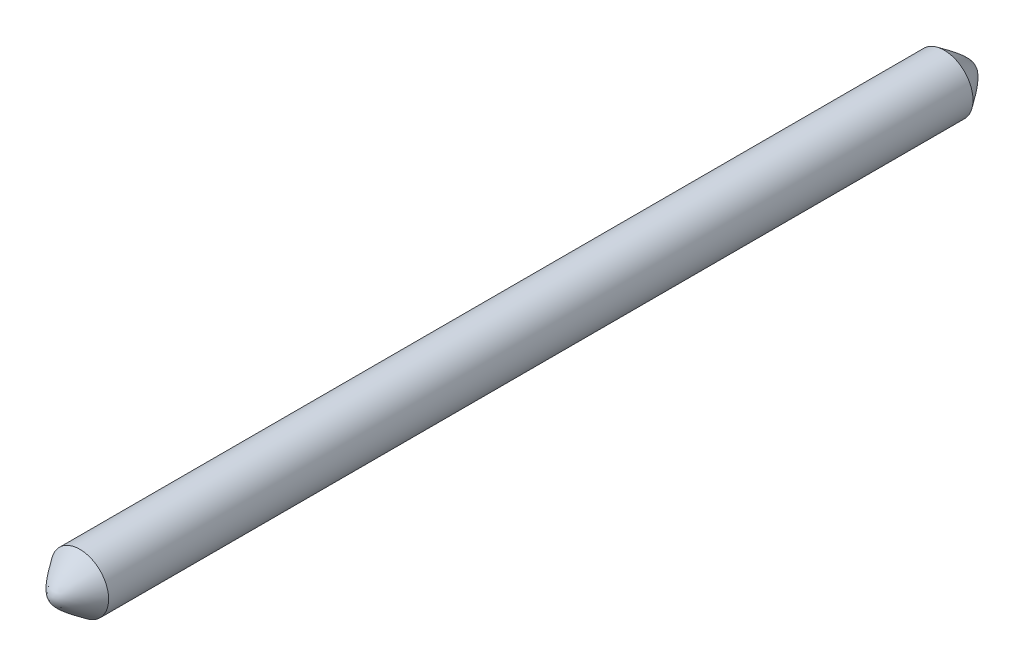
ISO-10303-21;
HEADER;
FILE_DESCRIPTION(('STEP AP214'),'2;1');
FILE_NAME('part.step','',(''),(''),'','','');
FILE_SCHEMA(('AUTOMOTIVE_DESIGN { 1 0 10303 214 1 1 1 1 }'));
ENDSEC;
DATA;
#1=APPLICATION_CONTEXT('core data for automotive mechanical design processes');
#2=APPLICATION_PROTOCOL_DEFINITION('international standard','automotive_design',2000,#1);
#3=PRODUCT_CONTEXT('',#1,'mechanical');
#4=PRODUCT('Part','Part','',(#3));
#5=PRODUCT_RELATED_PRODUCT_CATEGORY('part','',(#4));
#6=PRODUCT_DEFINITION_FORMATION('','',#4);
#7=PRODUCT_DEFINITION_CONTEXT('part definition',#1,'design');
#8=PRODUCT_DEFINITION('design','',#6,#7);
#9=PRODUCT_DEFINITION_SHAPE('','',#8);
#10=(LENGTH_UNIT() NAMED_UNIT(*) SI_UNIT(.MILLI.,.METRE.));
#11=(NAMED_UNIT(*) PLANE_ANGLE_UNIT() SI_UNIT($,.RADIAN.));
#12=(NAMED_UNIT(*) SI_UNIT($,.STERADIAN.) SOLID_ANGLE_UNIT());
#13=UNCERTAINTY_MEASURE_WITH_UNIT(LENGTH_MEASURE(1.E-05),#10,'distance_accuracy_value','');
#14=(GEOMETRIC_REPRESENTATION_CONTEXT(3) GLOBAL_UNCERTAINTY_ASSIGNED_CONTEXT((#13)) GLOBAL_UNIT_ASSIGNED_CONTEXT((#10,
#11,#12)) REPRESENTATION_CONTEXT('',''));
#15=CARTESIAN_POINT('',(0.,0.,0.));
#16=DIRECTION('',(0.,0.,1.));
#17=DIRECTION('',(1.,0.,0.));
#18=AXIS2_PLACEMENT_3D('',#15,#16,#17);
#19=CARTESIAN_POINT('',(0.,0.,76.2));
#20=DIRECTION('',(0.,0.,-1.));
#21=DIRECTION('',(-1.,0.,0.));
#22=AXIS2_PLACEMENT_3D('',#19,#20,#21);
#23=CYLINDRICAL_SURFACE('',#22,2.54);
#24=CARTESIAN_POINT('',(-2.54,-3.04103801602312E-12,76.2000845862362));
#25=CARTESIAN_POINT('',(-2.53999349698304,-0.13717648567686,76.200086927595));
#26=CARTESIAN_POINT('',(-2.5288527893179,-0.27443602373664,76.2001572765836));
#27=CARTESIAN_POINT('',(-2.48454768169249,-0.545451641506615,76.2001467424428));
#28=CARTESIAN_POINT('',(-2.4513602275577,-0.679203901324439,76.200065700844));
#29=CARTESIAN_POINT('',(-2.36206879535816,-0.944781802777988,76.2000170492411));
#30=CARTESIAN_POINT('',(-2.30510856573511,-1.07632091119194,76.2000540629433));
#31=CARTESIAN_POINT('',(-2.16992153988975,-1.32794728360604,76.2001255905543));
#32=CARTESIAN_POINT('',(-2.0916967347683,-1.44803561837391,76.2001601046968));
#33=CARTESIAN_POINT('',(-1.91618766254466,-1.67338435613288,76.2001956490769));
#34=CARTESIAN_POINT('',(-1.81890261658949,-1.77864415288757,76.2001966779458));
#35=CARTESIAN_POINT('',(-1.60806112702091,-1.97133178040241,76.2001847639142));
#36=CARTESIAN_POINT('',(-1.49450452188264,-2.05875943412517,76.2001718208751));
#37=CARTESIAN_POINT('',(-1.2542502504054,-2.21332989103388,76.2001080802919));
#38=CARTESIAN_POINT('',(-1.12755265155972,-2.28047279839711,76.2000572829423));
#39=CARTESIAN_POINT('',(-0.930553601798192,-2.36448585793705,76.2000361479739));
#40=CARTESIAN_POINT('',(-0.863697162202112,-2.3897141680493,76.2000382930603));
#41=CARTESIAN_POINT('',(-0.728079452450315,-2.43445904702555,76.2000774588079));
#42=CARTESIAN_POINT('',(-0.659318182294058,-2.45397561588793,76.2001144794691));
#43=CARTESIAN_POINT('',(-0.520400636507164,-2.48714404554093,76.2001613922752));
#44=CARTESIAN_POINT('',(-0.450244362721884,-2.50079591408905,76.200171284456));
#45=CARTESIAN_POINT('',(-0.309029910428212,-2.52214173017177,76.2001579222221));
#46=CARTESIAN_POINT('',(-0.237971731909446,-2.52983567763785,76.200134667807));
#47=CARTESIAN_POINT('',(-0.0954602281356198,-2.53920990590346,76.2001042604644));
#48=CARTESIAN_POINT('',(-0.0240069035094651,-2.54089019627143,76.2000971075114));
#49=CARTESIAN_POINT('',(0.118787306432225,-2.53822554125827,76.2001070490109));
#50=CARTESIAN_POINT('',(0.190128191748127,-2.53388059589681,76.2001241434634));
#51=CARTESIAN_POINT('',(0.332190652667195,-2.51919599413905,76.2001583917437));
#52=CARTESIAN_POINT('',(0.402912228033873,-2.50885633545373,76.2001755455715));
#53=CARTESIAN_POINT('',(0.543231813505336,-2.48225691237585,76.2001596205534));
#54=CARTESIAN_POINT('',(0.612829823596703,-2.46599714791259,76.2001265417068));
#55=CARTESIAN_POINT('',(0.750412983259382,-2.42766906971521,76.2000709369931));
#56=CARTESIAN_POINT('',(0.818398131771,-2.40560075216483,76.2000484111331));
#57=CARTESIAN_POINT('',(0.952251821774828,-2.3558274728542,76.2000349635544));
#58=CARTESIAN_POINT('',(1.01812036331188,-2.32812251121338,76.2000440418351));
#59=CARTESIAN_POINT('',(1.21184773989405,-2.23681826196654,76.2000854991792));
#60=CARTESIAN_POINT('',(1.33595217457533,-2.16499498600948,76.2001320915661));
#61=CARTESIAN_POINT('',(1.57027157572695,-2.00156996766211,76.2001848964266));
#62=CARTESIAN_POINT('',(1.68048654540007,-1.90996822983255,76.2001911089096));
#63=CARTESIAN_POINT('',(1.88399326344693,-1.70954605971817,76.2001938939493));
#64=CARTESIAN_POINT('',(1.97728498298651,-1.60072559809637,76.2001904664897));
#65=CARTESIAN_POINT('',(2.14426666713311,-1.36899021244833,76.2001411447618));
#66=CARTESIAN_POINT('',(2.21795663011954,-1.24607528725683,76.2000952504902));
#67=CARTESIAN_POINT('',(2.34366835650132,-0.989540395601292,76.2000347219431));
#68=CARTESIAN_POINT('',(2.39569012156701,-0.855920429962477,76.2000200876654));
#69=CARTESIAN_POINT('',(2.45632835741329,-0.650518649891663,76.2000903839677));
#70=CARTESIAN_POINT('',(2.47364585753888,-0.58119083949307,76.2001292284798));
#71=CARTESIAN_POINT('',(2.50238702423857,-0.441304519650376,76.2001592117772));
#72=CARTESIAN_POINT('',(2.51381069092007,-0.370746010228701,76.2001503505635));
#73=CARTESIAN_POINT('',(2.53067122012654,-0.228922439095543,76.2001204634017));
#74=CARTESIAN_POINT('',(2.536108091959,-0.157657378482686,76.2000994374726));
#75=CARTESIAN_POINT('',(2.54095962349172,-0.0149213361028563,76.200081009595));
#76=CARTESIAN_POINT('',(2.54037428316434,0.0565496456650631,76.2000836076466));
#77=CARTESIAN_POINT('',(2.53318444340542,0.199188204579735,76.2001096025685));
#78=CARTESIAN_POINT('',(2.52657994373368,0.27035578171438,76.2001329994397));
#79=CARTESIAN_POINT('',(2.5073999588077,0.411880497597634,76.2001543458698));
#80=CARTESIAN_POINT('',(2.49482447362679,0.482237636356196,76.2001522954289));
#81=CARTESIAN_POINT('',(2.46378814005909,0.621646844643629,76.2001127195962));
#82=CARTESIAN_POINT('',(2.44532728848407,0.690698913465492,76.2000751941851));
#83=CARTESIAN_POINT('',(2.40266535111888,0.826985957103936,76.2000331088692));
#84=CARTESIAN_POINT('',(2.37846426541206,0.894220931946898,76.2000285489639));
#85=CARTESIAN_POINT('',(2.29747912490954,1.09248381283008,76.2000455683079));
#86=CARTESIAN_POINT('',(2.23228513092784,1.2201951522415,76.2000977839282));
#87=CARTESIAN_POINT('',(2.08141379655454,1.46278855307947,76.2001659398644));
#88=CARTESIAN_POINT('',(1.99573646275967,1.57767061863771,76.200181880192));
#89=CARTESIAN_POINT('',(1.80630217486014,1.79143938224338,76.2001971157752));
#90=CARTESIAN_POINT('',(1.7025452144082,1.89032607467524,76.2001964110249));
#91=CARTESIAN_POINT('',(1.47990449938466,2.06927160933155,76.2001658634328));
#92=CARTESIAN_POINT('',(1.36102072525969,2.14933042721815,76.2001360205533));
#93=CARTESIAN_POINT('',(1.11149932067629,2.28835417428832,76.2000644010815));
#94=CARTESIAN_POINT('',(0.980861701226447,2.34731912322804,76.2000226245004));
#95=CARTESIAN_POINT('',(0.711541581773306,2.44247952887531,76.2000710597563));
#96=CARTESIAN_POINT('',(0.572859087692815,2.478675002346,76.2001612714961));
#97=CARTESIAN_POINT('',(0.291385516194262,2.527269590301,76.2001761004787));
#98=CARTESIAN_POINT('',(0.148594432147317,2.53966866638953,76.2001007174542));
#99=CARTESIAN_POINT('',(-0.137042522626879,2.54031819908428,76.2001001422658));
#100=CARTESIAN_POINT('',(-0.279888393305554,2.52856867705171,76.200174949969));
#101=CARTESIAN_POINT('',(-0.56158028390111,2.48125471956424,76.2001617298856));
#102=CARTESIAN_POINT('',(-0.700426296981659,2.44569024340867,76.2000737018206));
#103=CARTESIAN_POINT('',(-0.970179164637419,2.35175463815053,76.2000238788853));
#104=CARTESIAN_POINT('',(-1.10108588913962,2.29338313550651,76.2000620860826));
#105=CARTESIAN_POINT('',(-1.35123663520306,2.15549472711476,76.2001320119273));
#106=CARTESIAN_POINT('',(-1.47048105825638,2.07597854965464,76.200163730798));
#107=CARTESIAN_POINT('',(-1.69391906919926,1.89805867140753,76.2001962380119));
#108=CARTESIAN_POINT('',(-1.79811405722282,1.79965672965617,76.2001970292343));
#109=CARTESIAN_POINT('',(-1.98852249856104,1.58675488161058,76.2001829769784));
#110=CARTESIAN_POINT('',(-2.07473201349221,1.4722514586515,76.2001681300801));
#111=CARTESIAN_POINT('',(-2.22675375729282,1.23026961296691,76.2001012248612));
#112=CARTESIAN_POINT('',(-2.29255737097996,1.10278574010566,76.2000491508542));
#113=CARTESIAN_POINT('',(-2.37444341048816,0.904840600688562,76.2000284008782));
#114=CARTESIAN_POINT('',(-2.39893509323458,0.837740898730401,76.2000310435477));
#115=CARTESIAN_POINT('',(-2.44218554902602,0.701723595794444,76.2000712496223));
#116=CARTESIAN_POINT('',(-2.4609456779445,0.632806428958704,76.20010880476));
#117=CARTESIAN_POINT('',(-2.49775753871346,0.470915441641373,76.2001547524733));
#118=CARTESIAN_POINT('',(-2.51358270394138,0.377426423208198,76.2001496390599));
#119=CARTESIAN_POINT('',(-2.53470570006507,0.189304719426003,76.2001137468319));
#120=CARTESIAN_POINT('',(-2.54000448804707,0.0946721388399207,76.200082970351));
#121=CARTESIAN_POINT('',(-2.54,-3.04103801602312E-12,76.2000845862362));
#122=B_SPLINE_CURVE_WITH_KNOTS('',3,(#24,#25,#26,#27,#28,#29,#30,#31,#32,#33,#34,#35,#36,#37,
#38,#39,#40,#41,#42,#43,#44,#45,#46,#47,#48,#49,#50,#51,#52,#53,#54,#55,#56,#57,#58,#59,#60,#61,
#62,#63,#64,#65,#66,#67,#68,#69,#70,#71,#72,#73,#74,#75,#76,#77,#78,#79,#80,#81,#82,#83,#84,#85,
#86,#87,#88,#89,#90,#91,#92,#93,#94,#95,#96,#97,#98,#99,#100,#101,#102,#103,#104,#105,#106,#107,
#108,#109,#110,#111,#112,#113,#114,#115,#116,#117,#118,#119,#120,#121),.UNSPECIFIED.,.T.,.F.,(4,
2,2,2,2,2,2,2,2,2,2,2,2,2,2,2,2,2,2,2,2,2,2,2,2,2,2,2,2,2,2,2,2,2,2,2,2,2,2,2,2,2,2,2,2,2,2,2,
4),(0.,0.411222455094431,0.822875601804982,1.2508464555965,1.67877725028623,2.10672553503377,
2.53467806824199,2.96262840355756,3.17679434671601,3.39096028993523,3.60512594986732,
3.81929161226285,4.0334569338954,4.24762225482866,4.4617876575391,4.67595306280738,
4.89011860878439,5.10428415022407,5.53223430473072,5.96018436055584,6.38813514552334,
6.81608596587214,7.24403675323145,7.45820255709704,7.67236835706012,7.88653382406545,
8.10069929205418,8.31486476859012,8.52903024249617,8.74319583242052,8.95736141923535,
9.38531172792534,9.8132618987926,10.2412122199023,10.6691630941991,11.0971135676836,
11.525063726106,11.9530145750308,12.3809650454017,12.8089162471581,13.2368744583428,
13.6648179312398,14.0927215644558,14.5207188000932,14.9488964869562,15.1629737878919,
15.3770004067804,15.6608307541973,15.9446352938224),.UNSPECIFIED.);
#123=CARTESIAN_POINT('',(-2.54,-3.04103801602312E-12,76.2000845862362));
#124=VERTEX_POINT('',#123);
#125=EDGE_CURVE('E12',#124,#124,#122,.T.);
#126=ORIENTED_EDGE('',*,*,#125,.F.);
#127=EDGE_LOOP('',(#126));
#128=FACE_BOUND('',#127,.T.);
#129=CARTESIAN_POINT('',(-2.54,2.079697605941E-12,-8.45862354822719E-05));
#130=CARTESIAN_POINT('',(-2.53999349698332,-0.137176486129843,-8.69312459131235E-05));
#131=CARTESIAN_POINT('',(-2.52885278924446,-0.274436024648278,-0.000157275442477184));
#132=CARTESIAN_POINT('',(-2.48454768132177,-0.545451643310888,-0.000146750046882967));
#133=CARTESIAN_POINT('',(-2.45136022696289,-0.679203903562601,-6.57220046150355E-05));
#134=CARTESIAN_POINT('',(-2.36206879431232,-0.944781805401333,-1.71163433484851E-05));
#135=CARTESIAN_POINT('',(-2.30510856452686,-1.07632091378649,-5.41631553808292E-05));
#136=CARTESIAN_POINT('',(-2.16992153835465,-1.32794728611766,-0.000125708967258491));
#137=CARTESIAN_POINT('',(-2.09169673306958,-1.44803562083185,-0.000160208205260677));
#138=CARTESIAN_POINT('',(-1.91618766047624,-1.67338435851193,-0.000195694788074507));
#139=CARTESIAN_POINT('',(-1.81890261430442,-1.77864415523318,-0.000196680763137622));
#140=CARTESIAN_POINT('',(-1.60806112430609,-1.97133178262602,-0.000184686786333742));
#141=CARTESIAN_POINT('',(-1.4945045189544,-2.0587594362599,-0.000171706695819512));
#142=CARTESIAN_POINT('',(-1.25425024708615,-2.21332989291893,-0.000107948029528802));
#143=CARTESIAN_POINT('',(-1.12755264806743,-2.28047280012844,-5.71696478925056E-05));
#144=CARTESIAN_POINT('',(-0.930553598071686,-2.3644858594048,-3.60939634736529E-05));
#145=CARTESIAN_POINT('',(-0.863697158401242,-2.38971416942376,-3.82639678967028E-05));
#146=CARTESIAN_POINT('',(-0.728079448520029,-2.43445904820206,-7.74768091871421E-05));
#147=CARTESIAN_POINT('',(-0.65931817830875,-2.45397561695987,-0.000114519646063877));
#148=CARTESIAN_POINT('',(-0.520400632488693,-2.48714404637994,-0.000161453281130502));
#149=CARTESIAN_POINT('',(-0.45024435872694,-2.50079591480668,-0.000171344115268003));
#150=CARTESIAN_POINT('',(-0.309029906494981,-2.52214173065257,-0.000157968984503399));
#151=CARTESIAN_POINT('',(-0.237971728014362,-2.52983567800293,-0.000134703019218479));
#152=CARTESIAN_POINT('',(-0.0954602243259275,-2.53920990604519,-0.000104274030817158));
#153=CARTESIAN_POINT('',(-0.0240068997470274,-2.54089019630567,-9.71109820787086E-05));
#154=CARTESIAN_POINT('',(0.118787310095086,-2.53822554108546,-0.000107031811431813));
#155=CARTESIAN_POINT('',(0.190128195358668,-2.5338805956245,-0.000124115689443927));
#156=CARTESIAN_POINT('',(0.332190656078464,-2.51919599368555,-0.000158342990452021));
#157=CARTESIAN_POINT('',(0.40291223129892,-2.50885633492559,-0.000175486413470665));
#158=CARTESIAN_POINT('',(0.543231816476633,-2.48225691172179,-0.000159561655562934));
#159=CARTESIAN_POINT('',(0.61282982642048,-2.46599714720729,-0.000126493474037246));
#160=CARTESIAN_POINT('',(0.750412985796606,-2.42766906892708,-7.09247658673354E-05));
#161=CARTESIAN_POINT('',(0.818398134169137,-2.40560075134492,-4.84242461665313E-05));
#162=CARTESIAN_POINT('',(0.952251823886538,-2.35582747199702,-3.50240251187403E-05));
#163=CARTESIAN_POINT('',(1.01812036527618,-2.3281225103505,-4.41243231033805E-05));
#164=CARTESIAN_POINT('',(1.21184774186525,-2.23681826091222,-8.56276266540891E-05));
#165=CARTESIAN_POINT('',(1.33595217667864,-2.16499498472673,-0.000132223938123295));
#166=CARTESIAN_POINT('',(1.57027157802918,-2.00156996587195,-0.00018499014073983));
#167=CARTESIAN_POINT('',(1.68048654776954,-1.90996822776399,-0.000191160041210358));
#168=CARTESIAN_POINT('',(1.88399326562969,-1.70954605730372,-0.000193863345597776));
#169=CARTESIAN_POINT('',(1.97728498495493,-1.60072559565471,-0.00019039673311851));
#170=CARTESIAN_POINT('',(2.14426666868889,-1.3689902099989,-0.000141031606666379));
#171=CARTESIAN_POINT('',(2.21795663147745,-1.24607528482714,-9.51330891863517E-05));
#172=CARTESIAN_POINT('',(2.34366835759409,-0.989540393030477,-3.46360296225854E-05));
#173=CARTESIAN_POINT('',(2.39569012255613,-0.855920427212822,-2.00374851785729E-05));
#174=CARTESIAN_POINT('',(2.45632835820875,-0.650518646895561,-9.03709279638559E-05));
#175=CARTESIAN_POINT('',(2.47364585826356,-0.581190836416947,-0.000129225077553642));
#176=CARTESIAN_POINT('',(2.50238702481083,-0.441304516414878,-0.000159212244155626));
#177=CARTESIAN_POINT('',(2.51381069141074,-0.370746006913862,-0.000150345262037889));
#178=CARTESIAN_POINT('',(2.53067122042823,-0.228922435745026,-0.000120453660548074));
#179=CARTESIAN_POINT('',(2.53610809216303,-0.157657375176983,-9.94290600969332E-05));
#180=CARTESIAN_POINT('',(2.54095962350909,-0.0149213328953274,-8.10081788546456E-05));
#181=CARTESIAN_POINT('',(2.5403742830927,0.0565496488192297,-8.36118981719666E-05));
#182=CARTESIAN_POINT('',(2.53318444316482,0.199188207620088,-0.000109611825319258));
#183=CARTESIAN_POINT('',(2.52657994341321,0.270355784694285,-0.000133008033978732));
#184=CARTESIAN_POINT('',(2.5073999583377,0.411880500450276,-0.000154349475165498));
#185=CARTESIAN_POINT('',(2.494824473087,0.482237639142006,-0.000152294708004791));
#186=CARTESIAN_POINT('',(2.4637881393744,0.621646847358165,-0.000112726698577826));
#187=CARTESIAN_POINT('',(2.44532728771922,0.690698916174468,-7.52134370724439E-05));
#188=CARTESIAN_POINT('',(2.40266535019504,0.826985959789227,-3.3155962153685E-05));
#189=CARTESIAN_POINT('',(2.37846426440946,0.894220934614094,-2.86117482611294E-05));
#190=CARTESIAN_POINT('',(2.29747912367393,1.09248381543134,-4.56698032324641E-05));
#191=CARTESIAN_POINT('',(2.23228512954164,1.22019515478068,-9.79001225278873E-05));
#192=CARTESIAN_POINT('',(2.08141379485116,1.4627885555077,-0.00016604244634304));
#193=CARTESIAN_POINT('',(1.99573646088489,1.57767062101406,-0.000181954462550667));
#194=CARTESIAN_POINT('',(1.80630217265041,1.7914393844764,-0.000197115984638405));
#195=CARTESIAN_POINT('',(1.70254521203461,1.89032607681652,-0.000196365484668448));
#196=CARTESIAN_POINT('',(1.47990449681619,2.06927161116236,-0.000165749986388275));
#197=CARTESIAN_POINT('',(1.36102072267567,2.1493304288495,-0.000135884950473209));
#198=CARTESIAN_POINT('',(1.11149931808724,2.28835417553922,-6.42899917222969E-05));
#199=CARTESIAN_POINT('',(0.980861698648231,2.34731912429851,-2.25600799992683E-05));
#200=CARTESIAN_POINT('',(0.711541579325772,2.44247952958061,-7.10780801102821E-05));
#201=CARTESIAN_POINT('',(0.572859085368116,2.478675002875,-0.000161325894731721));
#202=CARTESIAN_POINT('',(0.29138551413391,2.52726959052905,-0.000176161020684314));
#203=CARTESIAN_POINT('',(0.148594430228496,2.53966866649304,-0.000100748064721021));
#204=CARTESIAN_POINT('',(-0.137042524284037,2.5403181989889,-0.00010011332892323));
#205=CARTESIAN_POINT('',(-0.279888394842595,2.52856867687614,-0.000174891416269981));
#206=CARTESIAN_POINT('',(-0.561580285200612,2.48125471926337,-0.000161674972452756));
#207=CARTESIAN_POINT('',(-0.700426298163741,2.44569024306272,-7.36801631033609E-05));
#208=CARTESIAN_POINT('',(-0.970179165769571,2.3517546376906,-2.39389927954955E-05));
#209=CARTESIAN_POINT('',(-1.10108589032727,2.29338313494327,-6.21946998790931E-05));
#210=CARTESIAN_POINT('',(-1.3512366364864,2.15549472631592,-0.000132148229642129));
#211=CARTESIAN_POINT('',(-1.4704810595801,2.07597854872386,-0.000163846278120754));
#212=CARTESIAN_POINT('',(-1.69391907062904,1.89805867014577,-0.00019628695957896));
#213=CARTESIAN_POINT('',(-1.79811405870965,1.79965672818453,-0.000197032474080924));
#214=CARTESIAN_POINT('',(-1.98852250009947,1.58675487969941,-0.000182905286871246));
#215=CARTESIAN_POINT('',(-2.0747320150248,1.47225145651036,-0.000168029168693499));
#216=CARTESIAN_POINT('',(-2.22675375870252,1.23026961042495,-0.000101108264569159));
#217=CARTESIAN_POINT('',(-2.29255737228623,1.10278573740149,-4.90478103222366E-05));
#218=CARTESIAN_POINT('',(-2.37444341160543,0.904840597760344,-2.83357492784886E-05));
#219=CARTESIAN_POINT('',(-2.3989350942831,0.837740895731174,-3.09939872892971E-05));
#220=CARTESIAN_POINT('',(-2.44218554992683,0.701723592663662,-7.12284154040713E-05));
#221=CARTESIAN_POINT('',(-2.46094567876639,0.632806425767387,-0.000108796338656579));
#222=CARTESIAN_POINT('',(-2.49775753920733,0.470915438908615,-0.000154754397359705));
#223=CARTESIAN_POINT('',(-2.51358270425039,0.377426421010254,-0.000149632218354874));
#224=CARTESIAN_POINT('',(-2.5347057001271,0.189304718318811,-0.000113737768605902));
#225=CARTESIAN_POINT('',(-2.54000448804684,0.0946721382886521,-8.29678301851751E-05));
#226=CARTESIAN_POINT('',(-2.54,2.079697605941E-12,-8.45862354822719E-05));
#227=B_SPLINE_CURVE_WITH_KNOTS('',3,(#129,#130,#131,#132,#133,#134,#135,#136,#137,#138,#139,
#140,#141,#142,#143,#144,#145,#146,#147,#148,#149,#150,#151,#152,#153,#154,#155,#156,#157,#158,
#159,#160,#161,#162,#163,#164,#165,#166,#167,#168,#169,#170,#171,#172,#173,#174,#175,#176,#177,
#178,#179,#180,#181,#182,#183,#184,#185,#186,#187,#188,#189,#190,#191,#192,#193,#194,#195,#196,
#197,#198,#199,#200,#201,#202,#203,#204,#205,#206,#207,#208,#209,#210,#211,#212,#213,#214,#215,
#216,#217,#218,#219,#220,#221,#222,#223,#224,#225,#226),.UNSPECIFIED.,.T.,.F.,(4,2,2,2,2,2,2,2,
2,2,2,2,2,2,2,2,2,2,2,2,2,2,2,2,2,2,2,2,2,2,2,2,2,2,2,2,2,2,2,2,2,2,2,2,2,2,2,2,4),(0.,
0.411222456470183,0.822875604564655,1.25084645849013,1.67877725329704,2.10672553839943,
2.53467807197068,2.9626284075005,3.17679435076912,3.39096029409514,3.60512595387826,
3.81929161613405,4.03345693762133,4.24762225840695,4.4617876607175,4.67595306558427,
4.89011861116692,5.10428415221987,5.53223430740273,5.96018436389108,6.38813514852037,
6.81608596852145,7.24403675625155,7.45820256031152,7.67236836046676,7.88653382731602,
8.10069929514843,8.31486477152482,8.5290302452758,8.74319583522906,8.95736142206961,
9.38531173081882,9.81326190184575,10.2412122231224,10.6691630971479,11.0971135703497,
11.5250637283304,11.9530145768113,12.3809650468417,12.8089162482573,13.236874459747,
13.664817932942,14.0927215667021,14.5207188028927,14.9488964900231,15.1629737910897,
15.3770004101076,15.6608307558549,15.9446352938137),.UNSPECIFIED.);
#228=CARTESIAN_POINT('',(-2.54,2.079697605941E-12,-8.45862354822719E-05));
#229=VERTEX_POINT('',#228);
#230=EDGE_CURVE('E106',#229,#229,#227,.T.);
#231=ORIENTED_EDGE('',*,*,#230,.T.);
#232=EDGE_LOOP('',(#231));
#233=FACE_BOUND('',#232,.T.);
#234=ADVANCED_FACE('F93',(#128,#233),#23,.T.);
#235=CARTESIAN_POINT('',(2.67819313749806,-2.59079773194686,74.6730244196627));
#236=CARTESIAN_POINT('',(2.2496833228468,-2.59079773194686,75.0417048025762));
#237=CARTESIAN_POINT('',(1.82117350819554,-2.59079773194686,75.3768045349288));
#238=CARTESIAN_POINT('',(1.39266369354428,-2.59079773194686,75.6893760880397));
#239=CARTESIAN_POINT('',(0.749898065491891,-2.59079773194686,76.0448564194377));
#240=CARTESIAN_POINT('',(0.107132437439498,-2.59079773194686,76.1428723886347));
#241=CARTESIAN_POINT('',(-0.107123375961637,-2.59079773194686,76.1428729683075));
#242=CARTESIAN_POINT('',(-0.749890816165043,-2.59079773194686,76.0448596365343));
#243=CARTESIAN_POINT('',(-1.39265825636845,-2.59079773194686,75.6893804475238));
#244=CARTESIAN_POINT('',(-1.82116988317072,-2.59079773194686,75.3768076792929));
#245=CARTESIAN_POINT('',(-2.24968150997299,-2.59079773194686,75.0417064704964));
#246=CARTESIAN_POINT('',(-2.67819313677526,-2.59079773194686,74.673024385175));
#247=CARTESIAN_POINT('',(2.67819313749806,-2.17627114646064,75.0105335618225));
#248=CARTESIAN_POINT('',(2.2496833228468,-2.17627114646064,75.436658922903));
#249=CARTESIAN_POINT('',(1.82117350819554,-2.17627114646064,75.8286275366601));
#250=CARTESIAN_POINT('',(1.39266369354428,-2.17627114646064,76.2007149807891));
#251=CARTESIAN_POINT('',(0.749898065491891,-2.17627114646064,76.6278016196594));
#252=CARTESIAN_POINT('',(0.107132437439498,-2.17627114646064,76.7457410884326));
#253=CARTESIAN_POINT('',(-0.107123375961637,-2.17627114646064,76.7457417545829));
#254=CARTESIAN_POINT('',(-0.749890816165043,-2.17627114646064,76.6278056727853));
#255=CARTESIAN_POINT('',(-1.39265825636845,-2.17627114646064,76.2007201683081));
#256=CARTESIAN_POINT('',(-1.82116988317072,-2.17627114646064,75.8286308400438));
#257=CARTESIAN_POINT('',(-2.24968150997299,-2.17627114646064,75.4366606628805));
#258=CARTESIAN_POINT('',(-2.67819313677526,-2.17627114646064,75.0105333673022));
#259=CARTESIAN_POINT('',(2.67819313749806,-1.76174456097442,75.3167605782808));
#260=CARTESIAN_POINT('',(2.2496833228468,-1.76174456097442,75.799748697046));
#261=CARTESIAN_POINT('',(1.82117350819554,-1.76174456097442,76.2477220283151));
#262=CARTESIAN_POINT('',(1.39266369354428,-1.76174456097442,76.6809650751832));
#263=CARTESIAN_POINT('',(0.749898065491891,-1.76174456097442,77.1818128554323));
#264=CARTESIAN_POINT('',(0.107132437439498,-1.76174456097442,77.320347900532));
#265=CARTESIAN_POINT('',(-0.107123375961637,-1.76174456097442,77.3203486140961));
#266=CARTESIAN_POINT('',(-0.749890816165043,-1.76174456097442,77.1818180053322));
#267=CARTESIAN_POINT('',(-1.39265825636845,-1.76174456097442,76.6809706702815));
#268=CARTESIAN_POINT('',(-1.82116988317072,-1.76174456097442,76.2477257269208));
#269=CARTESIAN_POINT('',(-2.24968150997299,-1.76174456097442,75.799750614253));
#270=CARTESIAN_POINT('',(-2.67819313677526,-1.76174456097442,75.3167602315485));
#271=CARTESIAN_POINT('',(2.67819313749806,-1.3472179754882,75.6015250749));
#272=CARTESIAN_POINT('',(2.2496833228468,-1.3472179754882,76.144391996381));
#273=CARTESIAN_POINT('',(1.82117350819554,-1.3472179754882,76.6534217396383));
#274=CARTESIAN_POINT('',(1.39266369354428,-1.3472179754882,77.1526084685881));
#275=CARTESIAN_POINT('',(0.749898065491891,-1.3472179754882,77.7218522383194));
#276=CARTESIAN_POINT('',(0.107132437439498,-1.3472179754882,77.8814731000794));
#277=CARTESIAN_POINT('',(-0.107123375961637,-1.3472179754882,77.8814740615217));
#278=CARTESIAN_POINT('',(-0.749890816165043,-1.3472179754882,77.7218577576074));
#279=CARTESIAN_POINT('',(-1.39265825636845,-1.3472179754882,77.1526149253162));
#280=CARTESIAN_POINT('',(-1.82116988317072,-1.3472179754882,76.6534260067408));
#281=CARTESIAN_POINT('',(-2.24968150997299,-1.3472179754882,76.1443939707539));
#282=CARTESIAN_POINT('',(-2.67819313677526,-1.3472179754882,75.6015248675513));
#283=CARTESIAN_POINT('',(2.67819313749806,-0.725427220903692,75.9234747955059));
#284=CARTESIAN_POINT('',(2.2496833228468,-0.725427220903692,76.5385886883884));
#285=CARTESIAN_POINT('',(1.82117350819554,-0.725427220903692,77.1227963601869));
#286=CARTESIAN_POINT('',(1.39266369354428,-0.725427220903692,77.6912278413897));
#287=CARTESIAN_POINT('',(0.749898065491891,-0.725427220903692,78.3911910733647));
#288=CARTESIAN_POINT('',(0.107132437439498,-0.725427220903692,78.5906167130612));
#289=CARTESIAN_POINT('',(-0.107123375961637,-0.725427220903692,78.5906178049262));
#290=CARTESIAN_POINT('',(-0.749890816165043,-0.725427220903692,78.3911981488907));
#291=CARTESIAN_POINT('',(-1.39265825636845,-0.725427220903692,77.6912352607034));
#292=CARTESIAN_POINT('',(-1.82116988317072,-0.725427220903692,77.1228010544237));
#293=CARTESIAN_POINT('',(-2.24968150997299,-0.725427220903692,76.5385914054992));
#294=CARTESIAN_POINT('',(-2.67819313677526,-0.725427220903692,75.9234749327156));
#295=CARTESIAN_POINT('',(2.67819313749806,-0.103636466319185,76.0120266273465));
#296=CARTESIAN_POINT('',(2.2496833228468,-0.103636466319185,76.6473382107532));
#297=CARTESIAN_POINT('',(1.82117350819554,-0.103636466319185,77.2524988312001));
#298=CARTESIAN_POINT('',(1.39266369354428,-0.103636466319185,77.8425109851798));
#299=CARTESIAN_POINT('',(0.749898065491891,-0.103636466319185,78.5823656702481));
#300=CARTESIAN_POINT('',(0.107132437439498,-0.103636466319185,78.8112670490042));
#301=CARTESIAN_POINT('',(-0.107123375961637,-0.103636466319185,78.8112684470053));
#302=CARTESIAN_POINT('',(-0.749890816165043,-0.103636466319185,78.5823733022116));
#303=CARTESIAN_POINT('',(-1.39265825636845,-0.103636466319185,77.8425185884543));
#304=CARTESIAN_POINT('',(-1.82116988317072,-0.103636466319185,77.2525040151777));
#305=CARTESIAN_POINT('',(-2.24968150997299,-0.103636466319185,76.6473408276762));
#306=CARTESIAN_POINT('',(-2.67819313677526,-0.103636466319185,76.0120265732502));
#307=CARTESIAN_POINT('',(2.67819313749806,0.103627702779104,76.0120270718564));
#308=CARTESIAN_POINT('',(2.2496833228468,0.103627702779104,76.6473387798656));
#309=CARTESIAN_POINT('',(1.82117350819554,0.103627702779104,77.2524996438106));
#310=CARTESIAN_POINT('',(1.39266369354428,0.103627702779104,77.8425118206908));
#311=CARTESIAN_POINT('',(0.749898065491891,0.103627702779104,78.5823667411451));
#312=CARTESIAN_POINT('',(0.107132437439498,0.103627702779104,78.8112683998033));
#313=CARTESIAN_POINT('',(-0.107123375961637,0.103627702779104,78.8112697979067));
#314=CARTESIAN_POINT('',(-0.749890816165043,0.103627702779104,78.5823743478487));
#315=CARTESIAN_POINT('',(-1.39265825636845,0.103627702779104,77.8425195083865));
#316=CARTESIAN_POINT('',(-1.82116988317072,0.103627702779104,77.2525046455308));
#317=CARTESIAN_POINT('',(-2.24968150997299,0.103627702779104,76.6473415014849));
#318=CARTESIAN_POINT('',(-2.67819313677526,0.103627702779104,76.0120271405603));
#319=CARTESIAN_POINT('',(2.67819313749806,0.725420210073973,75.9234780743535));
#320=CARTESIAN_POINT('',(2.2496833228468,0.725420210073973,76.5385926697384));
#321=CARTESIAN_POINT('',(1.82117350819554,0.725420210073973,77.1228007688058));
#322=CARTESIAN_POINT('',(1.39266369354428,0.725420210073973,77.6912331012068));
#323=CARTESIAN_POINT('',(0.749898065491891,0.725420210073973,78.3911978503926));
#324=CARTESIAN_POINT('',(0.107132437439498,0.725420210073973,78.5906240196311));
#325=CARTESIAN_POINT('',(-0.107123375961637,0.725420210073973,78.5906251386714));
#326=CARTESIAN_POINT('',(-0.749890816165043,0.725420210073973,78.3912049356506));
#327=CARTESIAN_POINT('',(-1.39265825636845,0.725420210073973,77.6912404973));
#328=CARTESIAN_POINT('',(-1.82116988317072,0.725420210073973,77.122805868373));
#329=CARTESIAN_POINT('',(-2.24968150997299,0.725420210073973,76.5385951286547));
#330=CARTESIAN_POINT('',(-2.67819313677526,0.725420210073973,75.9234779598708));
#331=CARTESIAN_POINT('',(2.67819313749806,1.34721271736884,75.6015285040655));
#332=CARTESIAN_POINT('',(2.2496833228468,1.34721271736884,76.1443961214574));
#333=CARTESIAN_POINT('',(1.82117350819554,1.34721271736884,76.6534269433236));
#334=CARTESIAN_POINT('',(1.39266369354428,1.34721271736884,77.1526145682782));
#335=CARTESIAN_POINT('',(0.749898065491891,1.34721271736884,77.7218592524628));
#336=CARTESIAN_POINT('',(0.107132437439498,1.34721271736884,77.8814804138515));
#337=CARTESIAN_POINT('',(-0.107123375961637,1.34721271736884,77.8814813028305));
#338=CARTESIAN_POINT('',(-0.749890816165043,1.34721271736884,77.7218648307483));
#339=CARTESIAN_POINT('',(-1.39265825636845,1.34721271736884,77.1526210694485));
#340=CARTESIAN_POINT('',(-1.82116988317072,1.34721271736884,76.6534312410775));
#341=CARTESIAN_POINT('',(-2.24968150997299,1.34721271736884,76.1443987266837));
#342=CARTESIAN_POINT('',(-2.67819313677526,1.34721271736884,75.6015287591918));
#343=CARTESIAN_POINT('',(2.67819313749806,1.76174105556542,75.3167627167535));
#344=CARTESIAN_POINT('',(2.2496833228468,1.76174105556542,75.7997515887383));
#345=CARTESIAN_POINT('',(1.82117350819554,1.76174105556542,76.2477254816061));
#346=CARTESIAN_POINT('',(1.39266369354428,1.76174105556542,76.6809691273285));
#347=CARTESIAN_POINT('',(0.749898065491891,1.76174105556542,77.1818177271882));
#348=CARTESIAN_POINT('',(0.107132437439498,1.76174105556542,77.3203526723828));
#349=CARTESIAN_POINT('',(-0.107123375961637,1.76174105556542,77.3203535007511));
#350=CARTESIAN_POINT('',(-0.749890816165043,1.76174105556542,77.1818224096087));
#351=CARTESIAN_POINT('',(-1.39265825636845,1.76174105556542,76.68097469516));
#352=CARTESIAN_POINT('',(-1.82116988317072,1.76174105556542,76.2477293067249));
#353=CARTESIAN_POINT('',(-2.24968150997299,1.76174105556542,75.799753721052));
#354=CARTESIAN_POINT('',(-2.67819313677526,1.76174105556542,75.3167631031816));
#355=CARTESIAN_POINT('',(2.67819313749806,2.176269393762,75.010534734159));
#356=CARTESIAN_POINT('',(2.2496833228468,2.176269393762,75.4366605352159));
#357=CARTESIAN_POINT('',(1.82117350819554,2.176269393762,75.8286294931739));
#358=CARTESIAN_POINT('',(1.39266369354428,2.176269393762,76.2007175248125));
#359=CARTESIAN_POINT('',(0.749898065491891,2.176269393762,76.6278039468367));
#360=CARTESIAN_POINT('',(0.107132437439498,2.176269393762,76.7457436090018));
#361=CARTESIAN_POINT('',(-0.107123375961637,2.176269393762,76.745744288422));
#362=CARTESIAN_POINT('',(-0.749890816165043,2.176269393762,76.627808242633));
#363=CARTESIAN_POINT('',(-1.39265825636845,2.176269393762,76.2007219374238));
#364=CARTESIAN_POINT('',(-1.82116988317072,2.176269393762,75.828632674755));
#365=CARTESIAN_POINT('',(-2.24968150997299,2.176269393762,75.4366623135963));
#366=CARTESIAN_POINT('',(-2.67819313677526,2.176269393762,75.0105349133907));
#367=CARTESIAN_POINT('',(2.67819313749806,2.59079773195858,74.6730243957066));
#368=CARTESIAN_POINT('',(2.2496833228468,2.59079773195858,75.0417049857927));
#369=CARTESIAN_POINT('',(1.82117350819554,2.59079773195858,75.3768049588721));
#370=CARTESIAN_POINT('',(1.39266369354428,2.59079773195858,75.6893764487185));
#371=CARTESIAN_POINT('',(0.749898065491891,2.59079773195858,76.0448561564017));
#372=CARTESIAN_POINT('',(0.107132437439498,2.59079773195858,76.142872410684));
#373=CARTESIAN_POINT('',(-0.107123375961637,2.59079773195858,76.1428729493316));
#374=CARTESIAN_POINT('',(-0.749890816165043,2.59079773195858,76.0448599126718));
#375=CARTESIAN_POINT('',(-1.39265825636845,2.59079773195858,75.689380136322));
#376=CARTESIAN_POINT('',(-1.82116988317072,2.59079773195858,75.3768073060586));
#377=CARTESIAN_POINT('',(-2.24968150997299,2.59079773195858,75.0417062877983));
#378=CARTESIAN_POINT('',(-2.67819313677526,2.59079773195858,74.673024351025));
#379=B_SPLINE_SURFACE_WITH_KNOTS('',5,5,((#235,#236,#237,#238,#239,#240,#241,#242,#243,#244,
#245,#246),(#247,#248,#249,#250,#251,#252,#253,#254,#255,#256,#257,#258),(#259,#260,#261,#262,
#263,#264,#265,#266,#267,#268,#269,#270),(#271,#272,#273,#274,#275,#276,#277,#278,#279,#280,
#281,#282),(#283,#284,#285,#286,#287,#288,#289,#290,#291,#292,#293,#294),(#295,#296,#297,#298,
#299,#300,#301,#302,#303,#304,#305,#306),(#307,#308,#309,#310,#311,#312,#313,#314,#315,#316,
#317,#318),(#319,#320,#321,#322,#323,#324,#325,#326,#327,#328,#329,#330),(#331,#332,#333,#334,
#335,#336,#337,#338,#339,#340,#341,#342),(#343,#344,#345,#346,#347,#348,#349,#350,#351,#352,
#353,#354),(#355,#356,#357,#358,#359,#360,#361,#362,#363,#364,#365,#366),(#367,#368,#369,#370,
#371,#372,#373,#374,#375,#376,#377,#378)),.UNSPECIFIED.,.F.,.F.,.F.,(6,3,3,6),(6,3,3,6),
(-2.59079773200445,-0.518164804573356,0.518156040918092,2.59079773190099),(-2.67819313749195,
-0.535644064235665,0.535635002770011,2.67819313678136),.UNSPECIFIED.);
#380=ORIENTED_EDGE('',*,*,#125,.T.);
#381=EDGE_LOOP('',(#380));
#382=FACE_BOUND('',#381,.T.);
#383=ADVANCED_FACE('F95',(#382),#379,.T.);
#384=CARTESIAN_POINT('',(2.67819313746235,-2.59079773196054,1.52697557523748));
#385=CARTESIAN_POINT('',(2.24968332281352,-2.59079773196054,1.15829501445896));
#386=CARTESIAN_POINT('',(1.82117350816469,-2.59079773196054,0.823195066475001));
#387=CARTESIAN_POINT('',(1.39266369351587,-2.59079773196054,0.51062357601288));
#388=CARTESIAN_POINT('',(0.749898065467124,-2.59079773196054,0.155143850161718));
#389=CARTESIAN_POINT('',(0.107132437418378,-2.59079773196054,0.0571275908730925));
#390=CARTESIAN_POINT('',(-0.107123375981543,-2.59079773196054,0.0571270522280823));
#391=CARTESIAN_POINT('',(-0.749890816181304,-2.59079773196054,0.15514009390868));
#392=CARTESIAN_POINT('',(-1.39265825638107,-2.59079773196054,0.510619888431463));
#393=CARTESIAN_POINT('',(-1.82116988318091,-2.59079773196054,0.82319271930707));
#394=CARTESIAN_POINT('',(-2.24968150998075,-2.59079773196054,1.1582937124584));
#395=CARTESIAN_POINT('',(-2.67819313678059,-2.59079773196054,1.52697561990101));
#396=CARTESIAN_POINT('',(2.67819313746235,-2.17627114647363,1.18946662504336));
#397=CARTESIAN_POINT('',(2.24968332281352,-2.17627114647363,0.763341096283841));
#398=CARTESIAN_POINT('',(1.8211735081647,-2.17627114647363,0.371372402424446));
#399=CARTESIAN_POINT('',(1.39266369351587,-2.17627114647362,-0.000715368255852936));
#400=CARTESIAN_POINT('',(0.749898065467125,-2.17627114647362,-0.427801498317016));
#401=CARTESIAN_POINT('',(0.107132437418379,-2.17627114647362,-0.545741081777132));
#402=CARTESIAN_POINT('',(-0.107123375981542,-2.17627114647362,-0.545741761192879));
#403=CARTESIAN_POINT('',(-0.749890816181303,-2.17627114647362,-0.427805794086823));
#404=CARTESIAN_POINT('',(-1.39265825638107,-2.17627114647362,-0.000719780829702721));
#405=CARTESIAN_POINT('',(-1.82116988318091,-2.17627114647363,0.371369220880966));
#406=CARTESIAN_POINT('',(-2.24968150998075,-2.17627114647363,0.763339317926325));
#407=CARTESIAN_POINT('',(-2.67819313678059,-2.17627114647363,1.18946644581198));
#408=CARTESIAN_POINT('',(2.67819313746235,-1.76174456098672,0.883239788280663));
#409=CARTESIAN_POINT('',(2.24968332281352,-1.76174456098671,0.400251410483727));
#410=CARTESIAN_POINT('',(1.8211735081647,-1.76174456098671,-0.0477219650817));
#411=CARTESIAN_POINT('',(1.39266369351587,-1.76174456098671,-0.480965088833812));
#412=CARTESIAN_POINT('',(0.749898065467125,-1.76174456098671,-0.98181308917479));
#413=CARTESIAN_POINT('',(0.107132437418379,-1.76174456098671,-1.12034784311023));
#414=CARTESIAN_POINT('',(-0.107123375981541,-1.76174456098671,-1.12034867147342));
#415=CARTESIAN_POINT('',(-0.749890816181303,-1.76174456098671,-0.981817771559343));
#416=CARTESIAN_POINT('',(-1.39265825638106,-1.76174456098671,-0.480970656608099));
#417=CARTESIAN_POINT('',(-1.82116988318091,-1.76174456098671,-0.047725790148202));
#418=CARTESIAN_POINT('',(-2.24968150998075,-1.76174456098671,0.400249278210742));
#419=CARTESIAN_POINT('',(-2.67819313678059,-1.76174456098672,0.883239401870079));
#420=CARTESIAN_POINT('',(2.67819313746235,-1.3472179754998,0.598475156311262));
#421=CARTESIAN_POINT('',(2.24968332281352,-1.3472179754998,0.0556083190158207));
#422=CARTESIAN_POINT('',(1.8211735081647,-1.3472179754998,-0.453421724345477));
#423=CARTESIAN_POINT('',(1.39266369351587,-1.3472179754998,-0.952608446396013));
#424=CARTESIAN_POINT('',(0.749898065467126,-1.3472179754998,-1.52185220882681));
#425=CARTESIAN_POINT('',(0.10713243741838,-1.3472179754998,-1.68147313629643));
#426=CARTESIAN_POINT('',(-0.10712337598154,-1.3472179754998,-1.68147402526783));
#427=CARTESIAN_POINT('',(-0.749890816181302,-1.3472179754998,-1.52185778706494));
#428=CARTESIAN_POINT('',(-1.39265825638106,-1.3472179754998,-0.952614947492998));
#429=CARTESIAN_POINT('',(-1.82116988318091,-1.3472179754998,-0.453426022031895));
#430=CARTESIAN_POINT('',(-2.24968150998075,-1.3472179754998,0.0556057138393332));
#431=CARTESIAN_POINT('',(-2.67819313678059,-1.3472179754998,0.598474901215089));
#432=CARTESIAN_POINT('',(2.67819313746235,-0.725427220914257,0.276525078598587));
#433=CARTESIAN_POINT('',(2.24968332281352,-0.725427220914254,-0.338588817538084));
#434=CARTESIAN_POINT('',(1.8211735081647,-0.725427220914253,-0.922796157567439));
#435=CARTESIAN_POINT('',(1.39266369351587,-0.72542722091425,-1.49122785304002));
#436=CARTESIAN_POINT('',(0.749898065467127,-0.725427220914248,-2.19119106852407));
#437=CARTESIAN_POINT('',(0.107132437418381,-0.725427220914247,-2.39061669946549));
#438=CARTESIAN_POINT('',(-0.10712337598154,-0.725427220914247,-2.39061781849612));
#439=CARTESIAN_POINT('',(-0.749890816181301,-0.725427220914248,-2.1911981537121));
#440=CARTESIAN_POINT('',(-1.39265825638106,-0.72542722091425,-1.49123524904993));
#441=CARTESIAN_POINT('',(-1.82116988318091,-0.725427220914253,-0.922801257054234));
#442=CARTESIAN_POINT('',(-2.24968150998075,-0.725427220914254,-0.338591276373762));
#443=CARTESIAN_POINT('',(-2.67819313678059,-0.725427220914257,0.276525193143201));
#444=CARTESIAN_POINT('',(2.67819313746235,-0.103636466328711,0.187973434004891));
#445=CARTESIAN_POINT('',(2.24968332281352,-0.103636466328708,-0.447338158459619));
#446=CARTESIAN_POINT('',(1.8211735081647,-0.103636466328706,-1.05249892238446));
#447=CARTESIAN_POINT('',(1.39266369351587,-0.103636466328704,-1.6425109430161));
#448=CARTESIAN_POINT('',(0.749898065467127,-0.103636466328702,-2.38236568290596));
#449=CARTESIAN_POINT('',(0.107132437418381,-0.103636466328701,-2.6112670489571));
#450=CARTESIAN_POINT('',(-0.107123375981539,-0.103636466328701,-2.61126844704778));
#451=CARTESIAN_POINT('',(-0.749890816181301,-0.103636466328702,-2.38237328955333));
#452=CARTESIAN_POINT('',(-1.39265825638106,-0.103636466328704,-1.64251863063146));
#453=CARTESIAN_POINT('',(-1.8211698831809,-0.103636466328706,-1.05250392401778));
#454=CARTESIAN_POINT('',(-2.24968150998075,-0.103636466328708,-0.447340880003995));
#455=CARTESIAN_POINT('',(-2.67819313678059,-0.103636466328711,0.187973365354467));
#456=CARTESIAN_POINT('',(2.67819313746235,0.103627702769924,0.187972866693612));
#457=CARTESIAN_POINT('',(2.24968332281352,0.103627702769926,-0.447338832269639));
#458=CARTESIAN_POINT('',(1.8211735081647,0.103627702769928,-1.05249955273898));
#459=CARTESIAN_POINT('',(1.39266369351587,0.10362770276993,-1.64251186294862));
#460=CARTESIAN_POINT('',(0.749898065467127,0.103627702769932,-2.3823667285446));
#461=CARTESIAN_POINT('',(0.107132437418381,0.103627702769933,-2.61126839985843));
#462=CARTESIAN_POINT('',(-0.107123375981539,0.103627702769933,-2.61126979785498));
#463=CARTESIAN_POINT('',(-0.749890816181301,0.103627702769932,-2.3823743604559));
#464=CARTESIAN_POINT('',(-1.39265825638106,0.10362770276993,-1.64251946614691));
#465=CARTESIAN_POINT('',(-1.8211698831809,0.103627702769928,-1.05250473663091));
#466=CARTESIAN_POINT('',(-2.24968150998075,0.103627702769926,-0.447341449118793));
#467=CARTESIAN_POINT('',(-2.67819313678059,0.103627702769924,0.187972920843482));
#468=CARTESIAN_POINT('',(2.67819313746235,0.725420210065826,0.276522051436783));
#469=CARTESIAN_POINT('',(2.24968332281352,0.725420210065828,-0.338592540701012));
#470=CARTESIAN_POINT('',(1.8211735081647,0.72542021006583,-0.922800971523702));
#471=CARTESIAN_POINT('',(1.39266369351587,0.725420210065832,-1.49123308964764));
#472=CARTESIAN_POINT('',(0.749898065467127,0.725420210065834,-2.19119785528574));
#473=CARTESIAN_POINT('',(0.107132437418381,0.725420210065835,-2.39062403323383));
#474=CARTESIAN_POINT('',(-0.10712337598154,0.725420210065835,-2.39062512509342));
#475=CARTESIAN_POINT('',(-0.749890816181301,0.725420210065834,-2.19120493078276));
#476=CARTESIAN_POINT('',(-1.39265825638106,0.725420210065832,-1.49124050889265));
#477=CARTESIAN_POINT('',(-1.82116988318091,0.72542021006583,-0.922805665694359));
#478=CARTESIAN_POINT('',(-2.24968150998075,0.725420210065828,-0.33859525773663));
#479=CARTESIAN_POINT('',(-2.67819313678059,0.725420210065826,0.276521914289268));
#480=CARTESIAN_POINT('',(2.67819313746235,1.34721271736173,0.598471264657298));
#481=CARTESIAN_POINT('',(2.24968332281352,1.34721271736173,0.0556035630714492));
#482=CARTESIAN_POINT('',(1.8211735081647,1.34721271736173,-0.45342695869867));
#483=CARTESIAN_POINT('',(1.39266369351587,1.34721271736173,-0.95261459054229));
#484=CARTESIAN_POINT('',(0.749898065467126,1.34721271736173,-1.52185928199698));
#485=CARTESIAN_POINT('',(0.10713243741838,1.34721271736173,-1.68148037763847));
#486=CARTESIAN_POINT('',(-0.107123375981541,1.34721271736173,-1.6814813390773));
#487=CARTESIAN_POINT('',(-0.749890816181302,1.34721271736173,-1.52186480125201));
#488=CARTESIAN_POINT('',(-1.39265825638106,1.34721271736173,-0.952621047223141));
#489=CARTESIAN_POINT('',(-1.82116988318091,1.34721271736173,-0.453431225744887));
#490=CARTESIAN_POINT('',(-2.24968150998075,1.34721271736173,0.0556015887413223));
#491=CARTESIAN_POINT('',(-2.67819313678059,1.34721271736173,0.598471472036144));
#492=CARTESIAN_POINT('',(2.67819313746235,1.76174105555899,0.883236916638422));
#493=CARTESIAN_POINT('',(2.24968332281352,1.761741055559,0.400248303671051));
#494=CARTESIAN_POINT('',(1.8211735081647,1.761741055559,-0.0477255449016547));
#495=CARTESIAN_POINT('',(1.39266369351587,1.761741055559,-0.480969113737396));
#496=CARTESIAN_POINT('',(0.749898065467125,1.761741055559,-0.98181749347345));
#497=CARTESIAN_POINT('',(0.107132437418379,1.761741055559,-1.12035272980501));
#498=CARTESIAN_POINT('',(-0.107123375981541,1.761741055559,-1.1203534433653));
#499=CARTESIAN_POINT('',(-0.749890816181303,1.761741055559,-0.98182264335134));
#500=CARTESIAN_POINT('',(-1.39265825638106,1.761741055559,-0.480974708789956));
#501=CARTESIAN_POINT('',(-1.82116988318091,1.761741055559,-0.0477292434660841));
#502=CARTESIAN_POINT('',(-2.24968150998075,1.761741055559,0.400246386500325));
#503=CARTESIAN_POINT('',(-2.67819313678059,1.76174105555899,0.883237263387749));
#504=CARTESIAN_POINT('',(2.67819313746235,2.17626939375626,1.18946507895283));
#505=CARTESIAN_POINT('',(2.24968332281352,2.17626939375626,0.763339445559932));
#506=CARTESIAN_POINT('',(1.8211735081647,2.17626939375626,0.371370567696607));
#507=CARTESIAN_POINT('',(1.39266369351587,2.17626939375627,-0.000717137382826117));
#508=CARTESIAN_POINT('',(0.749898065467124,2.17626939375627,-0.427804068197465));
#509=CARTESIAN_POINT('',(0.107132437418378,2.17626939375627,-0.545743615653177));
#510=CARTESIAN_POINT('',(-0.107123375981542,2.17626939375627,-0.545744281800209));
#511=CARTESIAN_POINT('',(-0.749890816181304,2.17626939375627,-0.427808121302119));
#512=CARTESIAN_POINT('',(-1.39265825638107,2.17626939375627,-0.000722324871199994));
#513=CARTESIAN_POINT('',(-1.82116988318091,2.17626939375626,0.371367264346132));
#514=CARTESIAN_POINT('',(-2.24968150998075,2.17626939375626,0.763337705602457));
#515=CARTESIAN_POINT('',(-2.67819313678059,2.17626939375626,1.189465273473));
#516=CARTESIAN_POINT('',(2.67819313746235,2.59079773195353,1.52697560939734));
#517=CARTESIAN_POINT('',(2.24968332281352,2.59079773195353,1.15829519715895));
#518=CARTESIAN_POINT('',(1.82117350816469,2.59079773195353,0.823195439703057));
#519=CARTESIAN_POINT('',(1.39266369351587,2.59079773195353,0.510623887209967));
#520=CARTESIAN_POINT('',(0.749898065467124,2.59079773195353,0.155143573992555));
#521=CARTESIAN_POINT('',(0.107132437418378,2.59079773195353,0.0571276098189201));
#522=CARTESIAN_POINT('',(-0.107123375981543,2.59079773195353,0.0571270301486565));
#523=CARTESIAN_POINT('',(-0.749890816181304,2.59079773195353,0.155140356913413));
#524=CARTESIAN_POINT('',(-1.39265825638107,2.59079773195353,0.510619527748133));
#525=CARTESIAN_POINT('',(-1.82116988318091,2.59079773195353,0.823192295356932));
#526=CARTESIAN_POINT('',(-2.24968150998075,2.59079773195353,1.1582935292433));
#527=CARTESIAN_POINT('',(-2.67819313678059,2.59079773195353,1.52697564386673));
#528=B_SPLINE_SURFACE_WITH_KNOTS('',5,5,((#384,#385,#386,#387,#388,#389,#390,#391,#392,#393,
#394,#395),(#396,#397,#398,#399,#400,#401,#402,#403,#404,#405,#406,#407),(#408,#409,#410,#411,
#412,#413,#414,#415,#416,#417,#418,#419),(#420,#421,#422,#423,#424,#425,#426,#427,#428,#429,
#430,#431),(#432,#433,#434,#435,#436,#437,#438,#439,#440,#441,#442,#443),(#444,#445,#446,#447,
#448,#449,#450,#451,#452,#453,#454,#455),(#456,#457,#458,#459,#460,#461,#462,#463,#464,#465,
#466,#467),(#468,#469,#470,#471,#472,#473,#474,#475,#476,#477,#478,#479),(#480,#481,#482,#483,
#484,#485,#486,#487,#488,#489,#490,#491),(#492,#493,#494,#495,#496,#497,#498,#499,#500,#501,
#502,#503),(#504,#505,#506,#507,#508,#509,#510,#511,#512,#513,#514,#515),(#516,#517,#518,#519,
#520,#521,#522,#523,#524,#525,#526,#527)),.UNSPECIFIED.,.F.,.F.,.F.,(6,3,3,6),(6,3,3,6),
(-2.59079773190294,-0.518164804468387,0.518156041024783,2.59079773201112),(-2.67819313745624,
-0.535644064212115,0.535635002787487,2.67819313678669),.UNSPECIFIED.);
#529=ORIENTED_EDGE('',*,*,#230,.F.);
#530=EDGE_LOOP('',(#529));
#531=FACE_BOUND('',#530,.T.);
#532=ADVANCED_FACE('F115',(#531),#528,.F.);
#533=CLOSED_SHELL('',(#234,#383,#532));
#534=MANIFOLD_SOLID_BREP('B2',#533);
#535=ADVANCED_BREP_SHAPE_REPRESENTATION('',(#18,#534),#14);
#536=SHAPE_DEFINITION_REPRESENTATION(#9,#535);
ENDSEC;
END-ISO-10303-21;
